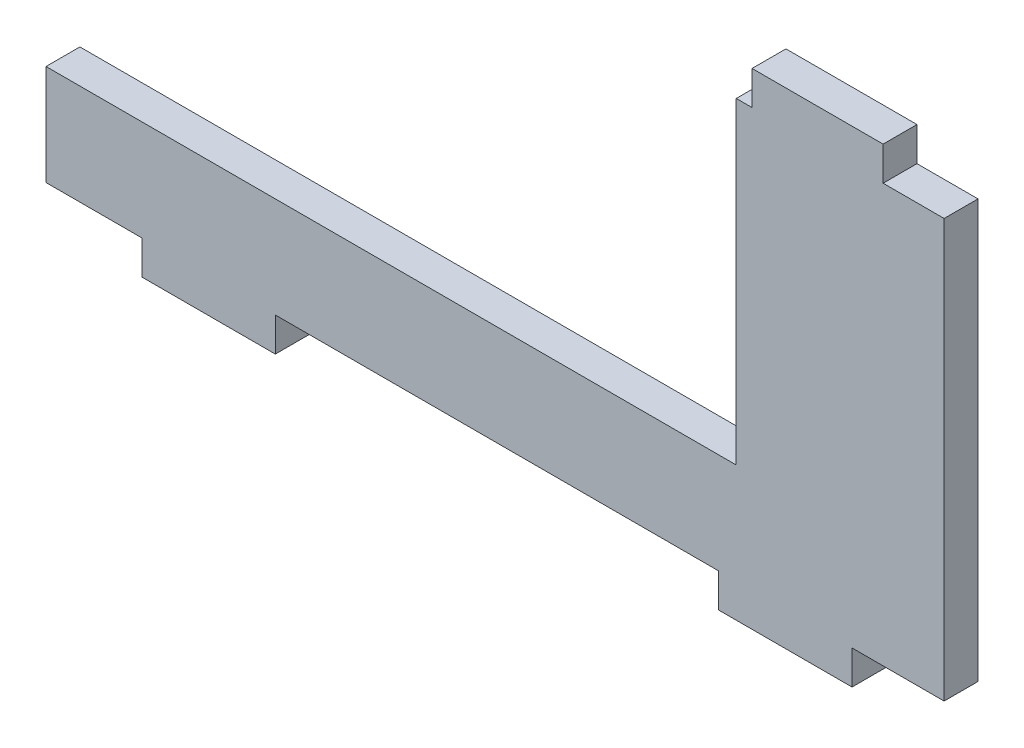
ISO-10303-21;
HEADER;
FILE_DESCRIPTION(('STEP AP214'),'2;1');
FILE_NAME('part.step','',(''),(''),'','','');
FILE_SCHEMA(('AUTOMOTIVE_DESIGN { 1 0 10303 214 1 1 1 1 }'));
ENDSEC;
DATA;
#1=APPLICATION_CONTEXT('core data for automotive mechanical design processes');
#2=APPLICATION_PROTOCOL_DEFINITION('international standard','automotive_design',2000,#1);
#3=PRODUCT_CONTEXT('',#1,'mechanical');
#4=PRODUCT('Part','Part','',(#3));
#5=PRODUCT_RELATED_PRODUCT_CATEGORY('part','',(#4));
#6=PRODUCT_DEFINITION_FORMATION('','',#4);
#7=PRODUCT_DEFINITION_CONTEXT('part definition',#1,'design');
#8=PRODUCT_DEFINITION('design','',#6,#7);
#9=PRODUCT_DEFINITION_SHAPE('','',#8);
#10=(LENGTH_UNIT() NAMED_UNIT(*) SI_UNIT(.MILLI.,.METRE.));
#11=(NAMED_UNIT(*) PLANE_ANGLE_UNIT() SI_UNIT($,.RADIAN.));
#12=(NAMED_UNIT(*) SI_UNIT($,.STERADIAN.) SOLID_ANGLE_UNIT());
#13=UNCERTAINTY_MEASURE_WITH_UNIT(LENGTH_MEASURE(1.E-05),#10,'distance_accuracy_value','');
#14=(GEOMETRIC_REPRESENTATION_CONTEXT(3) GLOBAL_UNCERTAINTY_ASSIGNED_CONTEXT((#13)) GLOBAL_UNIT_ASSIGNED_CONTEXT((#10,
#11,#12)) REPRESENTATION_CONTEXT('',''));
#15=CARTESIAN_POINT('',(0.,0.,0.));
#16=DIRECTION('',(0.,0.,1.));
#17=DIRECTION('',(1.,0.,0.));
#18=AXIS2_PLACEMENT_3D('',#15,#16,#17);
#19=CARTESIAN_POINT('',(0.,21.5,3.));
#20=DIRECTION('',(0.,1.,0.));
#21=DIRECTION('',(0.,0.,1.));
#22=AXIS2_PLACEMENT_3D('',#19,#20,#21);
#23=PLANE('',#22);
#24=DIRECTION('',(1.,0.,0.));
#25=VECTOR('',#24,1.);
#26=CARTESIAN_POINT('',(0.,21.5,0.));
#27=LINE('',#26,#25);
#28=CARTESIAN_POINT('',(22.75,21.5,0.));
#29=VERTEX_POINT('',#28);
#30=CARTESIAN_POINT('',(34.35,21.5,0.));
#31=VERTEX_POINT('',#30);
#32=EDGE_CURVE('E202',#29,#31,#27,.T.);
#33=ORIENTED_EDGE('',*,*,#32,.F.);
#34=DIRECTION('',(0.,0.,-1.));
#35=VECTOR('',#34,1.);
#36=CARTESIAN_POINT('',(22.75,21.5,3.));
#37=LINE('',#36,#35);
#38=CARTESIAN_POINT('',(22.75,21.5,3.));
#39=VERTEX_POINT('',#38);
#40=EDGE_CURVE('E11',#39,#29,#37,.T.);
#41=ORIENTED_EDGE('',*,*,#40,.F.);
#42=DIRECTION('',(1.,0.,0.));
#43=VECTOR('',#42,1.);
#44=CARTESIAN_POINT('',(0.,21.5,3.));
#45=LINE('',#44,#43);
#46=CARTESIAN_POINT('',(34.35,21.5,3.));
#47=VERTEX_POINT('',#46);
#48=EDGE_CURVE('E263',#39,#47,#45,.T.);
#49=ORIENTED_EDGE('',*,*,#48,.T.);
#50=DIRECTION('',(0.,0.,-1.));
#51=VECTOR('',#50,1.);
#52=CARTESIAN_POINT('',(34.35,21.5,3.));
#53=LINE('',#52,#51);
#54=EDGE_CURVE('E58',#47,#31,#53,.T.);
#55=ORIENTED_EDGE('',*,*,#54,.T.);
#56=EDGE_LOOP('',(#33,#41,#49,#55));
#57=FACE_BOUND('',#56,.T.);
#58=ADVANCED_FACE('F41',(#57),#23,.T.);
#59=CARTESIAN_POINT('',(22.75,0.,3.));
#60=DIRECTION('',(1.,0.,0.));
#61=DIRECTION('',(0.,0.,-1.));
#62=AXIS2_PLACEMENT_3D('',#59,#60,#61);
#63=PLANE('',#62);
#64=DIRECTION('',(0.,-1.,0.));
#65=VECTOR('',#64,1.);
#66=CARTESIAN_POINT('',(22.75,0.,0.));
#67=LINE('',#66,#65);
#68=CARTESIAN_POINT('',(22.75,18.5,0.));
#69=VERTEX_POINT('',#68);
#70=EDGE_CURVE('E205',#29,#69,#67,.T.);
#71=ORIENTED_EDGE('',*,*,#70,.T.);
#72=DIRECTION('',(0.,0.,-1.));
#73=VECTOR('',#72,1.);
#74=CARTESIAN_POINT('',(22.75,18.5,3.));
#75=LINE('',#74,#73);
#76=CARTESIAN_POINT('',(22.75,18.5,3.));
#77=VERTEX_POINT('',#76);
#78=EDGE_CURVE('E50',#77,#69,#75,.T.);
#79=ORIENTED_EDGE('',*,*,#78,.F.);
#80=DIRECTION('',(0.,-1.,0.));
#81=VECTOR('',#80,1.);
#82=CARTESIAN_POINT('',(22.75,0.,3.));
#83=LINE('',#82,#81);
#84=EDGE_CURVE('E336',#39,#77,#83,.T.);
#85=ORIENTED_EDGE('',*,*,#84,.F.);
#86=ORIENTED_EDGE('',*,*,#40,.T.);
#87=EDGE_LOOP('',(#71,#79,#85,#86));
#88=FACE_BOUND('',#87,.T.);
#89=ADVANCED_FACE('F320',(#88),#63,.F.);
#90=CARTESIAN_POINT('',(0.,18.5,3.));
#91=DIRECTION('',(0.,1.,0.));
#92=DIRECTION('',(0.,0.,1.));
#93=AXIS2_PLACEMENT_3D('',#90,#91,#92);
#94=PLANE('',#93);
#95=DIRECTION('',(1.,0.,0.));
#96=VECTOR('',#95,1.);
#97=CARTESIAN_POINT('',(0.,18.5,0.));
#98=LINE('',#97,#96);
#99=CARTESIAN_POINT('',(21.35,18.5,0.));
#100=VERTEX_POINT('',#99);
#101=EDGE_CURVE('E209',#100,#69,#98,.T.);
#102=ORIENTED_EDGE('',*,*,#101,.F.);
#103=DIRECTION('',(0.,0.,-1.));
#104=VECTOR('',#103,1.);
#105=CARTESIAN_POINT('',(21.35,18.5,3.));
#106=LINE('',#105,#104);
#107=CARTESIAN_POINT('',(21.35,18.5,3.));
#108=VERTEX_POINT('',#107);
#109=EDGE_CURVE('E308',#108,#100,#106,.T.);
#110=ORIENTED_EDGE('',*,*,#109,.F.);
#111=DIRECTION('',(1.,0.,0.));
#112=VECTOR('',#111,1.);
#113=CARTESIAN_POINT('',(0.,18.5,3.));
#114=LINE('',#113,#112);
#115=EDGE_CURVE('E317',#108,#77,#114,.T.);
#116=ORIENTED_EDGE('',*,*,#115,.T.);
#117=ORIENTED_EDGE('',*,*,#78,.T.);
#118=EDGE_LOOP('',(#102,#110,#116,#117));
#119=FACE_BOUND('',#118,.T.);
#120=ADVANCED_FACE('F315',(#119),#94,.T.);
#121=CARTESIAN_POINT('',(21.35,0.,3.));
#122=DIRECTION('',(1.,0.,0.));
#123=DIRECTION('',(0.,1.,0.));
#124=AXIS2_PLACEMENT_3D('',#121,#122,#123);
#125=PLANE('',#124);
#126=DIRECTION('',(0.,-1.,0.));
#127=VECTOR('',#126,1.);
#128=CARTESIAN_POINT('',(21.35,0.,0.));
#129=LINE('',#128,#127);
#130=CARTESIAN_POINT('',(21.35,-9.6,0.));
#131=VERTEX_POINT('',#130);
#132=EDGE_CURVE('E213',#100,#131,#129,.T.);
#133=ORIENTED_EDGE('',*,*,#132,.T.);
#134=DIRECTION('',(0.,0.,-1.));
#135=VECTOR('',#134,1.);
#136=CARTESIAN_POINT('',(21.35,-9.6,3.));
#137=LINE('',#136,#135);
#138=CARTESIAN_POINT('',(21.35,-9.6,3.));
#139=VERTEX_POINT('',#138);
#140=EDGE_CURVE('E305',#139,#131,#137,.T.);
#141=ORIENTED_EDGE('',*,*,#140,.F.);
#142=DIRECTION('',(0.,-1.,0.));
#143=VECTOR('',#142,1.);
#144=CARTESIAN_POINT('',(21.35,0.,3.));
#145=LINE('',#144,#143);
#146=EDGE_CURVE('E331',#108,#139,#145,.T.);
#147=ORIENTED_EDGE('',*,*,#146,.F.);
#148=ORIENTED_EDGE('',*,*,#109,.T.);
#149=EDGE_LOOP('',(#133,#141,#147,#148));
#150=FACE_BOUND('',#149,.T.);
#151=ADVANCED_FACE('F328',(#150),#125,.F.);
#152=CARTESIAN_POINT('',(0.,-9.6,3.));
#153=DIRECTION('',(0.,1.,0.));
#154=DIRECTION('',(0.,0.,1.));
#155=AXIS2_PLACEMENT_3D('',#152,#153,#154);
#156=PLANE('',#155);
#157=DIRECTION('',(1.,0.,0.));
#158=VECTOR('',#157,1.);
#159=CARTESIAN_POINT('',(0.,-9.6,0.));
#160=LINE('',#159,#158);
#161=CARTESIAN_POINT('',(-39.75,-9.6,0.));
#162=VERTEX_POINT('',#161);
#163=EDGE_CURVE('E217',#162,#131,#160,.T.);
#164=ORIENTED_EDGE('',*,*,#163,.F.);
#165=DIRECTION('',(0.,0.,-1.));
#166=VECTOR('',#165,1.);
#167=CARTESIAN_POINT('',(-39.75,-9.6,3.));
#168=LINE('',#167,#166);
#169=CARTESIAN_POINT('',(-39.75,-9.6,3.));
#170=VERTEX_POINT('',#169);
#171=EDGE_CURVE('E302',#170,#162,#168,.T.);
#172=ORIENTED_EDGE('',*,*,#171,.F.);
#173=DIRECTION('',(1.,0.,0.));
#174=VECTOR('',#173,1.);
#175=CARTESIAN_POINT('',(0.,-9.6,3.));
#176=LINE('',#175,#174);
#177=EDGE_CURVE('E334',#170,#139,#176,.T.);
#178=ORIENTED_EDGE('',*,*,#177,.T.);
#179=ORIENTED_EDGE('',*,*,#140,.T.);
#180=EDGE_LOOP('',(#164,#172,#178,#179));
#181=FACE_BOUND('',#180,.T.);
#182=ADVANCED_FACE('F405',(#181),#156,.T.);
#183=CARTESIAN_POINT('',(-39.75,0.,3.));
#184=DIRECTION('',(1.,0.,0.));
#185=DIRECTION('',(0.,1.,0.));
#186=AXIS2_PLACEMENT_3D('',#183,#184,#185);
#187=PLANE('',#186);
#188=DIRECTION('',(0.,-1.,0.));
#189=VECTOR('',#188,1.);
#190=CARTESIAN_POINT('',(-39.75,0.,0.));
#191=LINE('',#190,#189);
#192=CARTESIAN_POINT('',(-39.75,-18.5,0.));
#193=VERTEX_POINT('',#192);
#194=EDGE_CURVE('E221',#162,#193,#191,.T.);
#195=ORIENTED_EDGE('',*,*,#194,.T.);
#196=DIRECTION('',(0.,0.,-1.));
#197=VECTOR('',#196,1.);
#198=CARTESIAN_POINT('',(-39.75,-18.5,3.));
#199=LINE('',#198,#197);
#200=CARTESIAN_POINT('',(-39.75,-18.5,3.));
#201=VERTEX_POINT('',#200);
#202=EDGE_CURVE('E298',#201,#193,#199,.T.);
#203=ORIENTED_EDGE('',*,*,#202,.F.);
#204=DIRECTION('',(0.,-1.,0.));
#205=VECTOR('',#204,1.);
#206=CARTESIAN_POINT('',(-39.75,0.,3.));
#207=LINE('',#206,#205);
#208=EDGE_CURVE('E345',#170,#201,#207,.T.);
#209=ORIENTED_EDGE('',*,*,#208,.F.);
#210=ORIENTED_EDGE('',*,*,#171,.T.);
#211=EDGE_LOOP('',(#195,#203,#209,#210));
#212=FACE_BOUND('',#211,.T.);
#213=ADVANCED_FACE('F408',(#212),#187,.F.);
#214=CARTESIAN_POINT('',(0.,-18.5,3.));
#215=DIRECTION('',(0.,1.,0.));
#216=DIRECTION('',(0.,0.,1.));
#217=AXIS2_PLACEMENT_3D('',#214,#215,#216);
#218=PLANE('',#217);
#219=DIRECTION('',(1.,0.,0.));
#220=VECTOR('',#219,1.);
#221=CARTESIAN_POINT('',(0.,-18.5,0.));
#222=LINE('',#221,#220);
#223=CARTESIAN_POINT('',(-31.25,-18.5,0.));
#224=VERTEX_POINT('',#223);
#225=EDGE_CURVE('E224',#193,#224,#222,.T.);
#226=ORIENTED_EDGE('',*,*,#225,.T.);
#227=DIRECTION('',(0.,0.,-1.));
#228=VECTOR('',#227,1.);
#229=CARTESIAN_POINT('',(-31.25,-18.5,3.));
#230=LINE('',#229,#228);
#231=CARTESIAN_POINT('',(-31.25,-18.5,3.));
#232=VERTEX_POINT('',#231);
#233=EDGE_CURVE('E295',#232,#224,#230,.T.);
#234=ORIENTED_EDGE('',*,*,#233,.F.);
#235=DIRECTION('',(1.,0.,0.));
#236=VECTOR('',#235,1.);
#237=CARTESIAN_POINT('',(0.,-18.5,3.));
#238=LINE('',#237,#236);
#239=EDGE_CURVE('E348',#201,#232,#238,.T.);
#240=ORIENTED_EDGE('',*,*,#239,.F.);
#241=ORIENTED_EDGE('',*,*,#202,.T.);
#242=EDGE_LOOP('',(#226,#234,#240,#241));
#243=FACE_BOUND('',#242,.T.);
#244=ADVANCED_FACE('F412',(#243),#218,.F.);
#245=CARTESIAN_POINT('',(-31.25,0.,3.));
#246=DIRECTION('',(-1.,0.,0.));
#247=DIRECTION('',(0.,0.,1.));
#248=AXIS2_PLACEMENT_3D('',#245,#246,#247);
#249=PLANE('',#248);
#250=DIRECTION('',(0.,1.,0.));
#251=VECTOR('',#250,1.);
#252=CARTESIAN_POINT('',(-31.25,0.,0.));
#253=LINE('',#252,#251);
#254=CARTESIAN_POINT('',(-31.25,-21.5,0.));
#255=VERTEX_POINT('',#254);
#256=EDGE_CURVE('E228',#255,#224,#253,.T.);
#257=ORIENTED_EDGE('',*,*,#256,.F.);
#258=DIRECTION('',(0.,0.,-1.));
#259=VECTOR('',#258,1.);
#260=CARTESIAN_POINT('',(-31.25,-21.5,3.));
#261=LINE('',#260,#259);
#262=CARTESIAN_POINT('',(-31.25,-21.5,3.));
#263=VERTEX_POINT('',#262);
#264=EDGE_CURVE('E292',#263,#255,#261,.T.);
#265=ORIENTED_EDGE('',*,*,#264,.F.);
#266=DIRECTION('',(0.,1.,0.));
#267=VECTOR('',#266,1.);
#268=CARTESIAN_POINT('',(-31.25,0.,3.));
#269=LINE('',#268,#267);
#270=EDGE_CURVE('E351',#263,#232,#269,.T.);
#271=ORIENTED_EDGE('',*,*,#270,.T.);
#272=ORIENTED_EDGE('',*,*,#233,.T.);
#273=EDGE_LOOP('',(#257,#265,#271,#272));
#274=FACE_BOUND('',#273,.T.);
#275=ADVANCED_FACE('F416',(#274),#249,.T.);
#276=CARTESIAN_POINT('',(0.,-21.5,3.));
#277=DIRECTION('',(0.,1.,0.));
#278=DIRECTION('',(0.,0.,1.));
#279=AXIS2_PLACEMENT_3D('',#276,#277,#278);
#280=PLANE('',#279);
#281=DIRECTION('',(1.,0.,0.));
#282=VECTOR('',#281,1.);
#283=CARTESIAN_POINT('',(0.,-21.5,0.));
#284=LINE('',#283,#282);
#285=CARTESIAN_POINT('',(-19.45,-21.5,0.));
#286=VERTEX_POINT('',#285);
#287=EDGE_CURVE('E232',#255,#286,#284,.T.);
#288=ORIENTED_EDGE('',*,*,#287,.T.);
#289=DIRECTION('',(0.,0.,-1.));
#290=VECTOR('',#289,1.);
#291=CARTESIAN_POINT('',(-19.45,-21.5,3.));
#292=LINE('',#291,#290);
#293=CARTESIAN_POINT('',(-19.45,-21.5,3.));
#294=VERTEX_POINT('',#293);
#295=EDGE_CURVE('E288',#294,#286,#292,.T.);
#296=ORIENTED_EDGE('',*,*,#295,.F.);
#297=DIRECTION('',(1.,0.,0.));
#298=VECTOR('',#297,1.);
#299=CARTESIAN_POINT('',(0.,-21.5,3.));
#300=LINE('',#299,#298);
#301=EDGE_CURVE('E355',#263,#294,#300,.T.);
#302=ORIENTED_EDGE('',*,*,#301,.F.);
#303=ORIENTED_EDGE('',*,*,#264,.T.);
#304=EDGE_LOOP('',(#288,#296,#302,#303));
#305=FACE_BOUND('',#304,.T.);
#306=ADVANCED_FACE('F420',(#305),#280,.F.);
#307=CARTESIAN_POINT('',(-19.45,0.,3.));
#308=DIRECTION('',(-1.,0.,0.));
#309=DIRECTION('',(0.,0.,1.));
#310=AXIS2_PLACEMENT_3D('',#307,#308,#309);
#311=PLANE('',#310);
#312=DIRECTION('',(0.,1.,0.));
#313=VECTOR('',#312,1.);
#314=CARTESIAN_POINT('',(-19.45,0.,0.));
#315=LINE('',#314,#313);
#316=CARTESIAN_POINT('',(-19.45,-18.5,0.));
#317=VERTEX_POINT('',#316);
#318=EDGE_CURVE('E235',#286,#317,#315,.T.);
#319=ORIENTED_EDGE('',*,*,#318,.T.);
#320=DIRECTION('',(0.,0.,-1.));
#321=VECTOR('',#320,1.);
#322=CARTESIAN_POINT('',(-19.45,-18.5,3.));
#323=LINE('',#322,#321);
#324=CARTESIAN_POINT('',(-19.45,-18.5,3.));
#325=VERTEX_POINT('',#324);
#326=EDGE_CURVE('E284',#325,#317,#323,.T.);
#327=ORIENTED_EDGE('',*,*,#326,.F.);
#328=DIRECTION('',(0.,1.,0.));
#329=VECTOR('',#328,1.);
#330=CARTESIAN_POINT('',(-19.45,0.,3.));
#331=LINE('',#330,#329);
#332=EDGE_CURVE('E358',#294,#325,#331,.T.);
#333=ORIENTED_EDGE('',*,*,#332,.F.);
#334=ORIENTED_EDGE('',*,*,#295,.T.);
#335=EDGE_LOOP('',(#319,#327,#333,#334));
#336=FACE_BOUND('',#335,.T.);
#337=ADVANCED_FACE('F422',(#336),#311,.F.);
#338=CARTESIAN_POINT('',(0.,-18.5,3.));
#339=DIRECTION('',(0.,1.,0.));
#340=DIRECTION('',(0.,0.,1.));
#341=AXIS2_PLACEMENT_3D('',#338,#339,#340);
#342=PLANE('',#341);
#343=DIRECTION('',(1.,0.,0.));
#344=VECTOR('',#343,1.);
#345=CARTESIAN_POINT('',(0.,-18.5,0.));
#346=LINE('',#345,#344);
#347=CARTESIAN_POINT('',(19.8,-18.5,0.));
#348=VERTEX_POINT('',#347);
#349=EDGE_CURVE('E239',#317,#348,#346,.T.);
#350=ORIENTED_EDGE('',*,*,#349,.T.);
#351=DIRECTION('',(0.,0.,-1.));
#352=VECTOR('',#351,1.);
#353=CARTESIAN_POINT('',(19.8,-18.5,3.));
#354=LINE('',#353,#352);
#355=CARTESIAN_POINT('',(19.8,-18.5,3.));
#356=VERTEX_POINT('',#355);
#357=EDGE_CURVE('E281',#356,#348,#354,.T.);
#358=ORIENTED_EDGE('',*,*,#357,.F.);
#359=DIRECTION('',(1.,0.,0.));
#360=VECTOR('',#359,1.);
#361=CARTESIAN_POINT('',(0.,-18.5,3.));
#362=LINE('',#361,#360);
#363=EDGE_CURVE('E362',#325,#356,#362,.T.);
#364=ORIENTED_EDGE('',*,*,#363,.F.);
#365=ORIENTED_EDGE('',*,*,#326,.T.);
#366=EDGE_LOOP('',(#350,#358,#364,#365));
#367=FACE_BOUND('',#366,.T.);
#368=ADVANCED_FACE('F425',(#367),#342,.F.);
#369=CARTESIAN_POINT('',(19.8,0.,3.));
#370=DIRECTION('',(-1.,0.,0.));
#371=DIRECTION('',(0.,0.,1.));
#372=AXIS2_PLACEMENT_3D('',#369,#370,#371);
#373=PLANE('',#372);
#374=DIRECTION('',(0.,1.,0.));
#375=VECTOR('',#374,1.);
#376=CARTESIAN_POINT('',(19.8,0.,0.));
#377=LINE('',#376,#375);
#378=CARTESIAN_POINT('',(19.8,-21.5,0.));
#379=VERTEX_POINT('',#378);
#380=EDGE_CURVE('E243',#379,#348,#377,.T.);
#381=ORIENTED_EDGE('',*,*,#380,.F.);
#382=DIRECTION('',(0.,0.,-1.));
#383=VECTOR('',#382,1.);
#384=CARTESIAN_POINT('',(19.8,-21.5,3.));
#385=LINE('',#384,#383);
#386=CARTESIAN_POINT('',(19.8,-21.5,3.));
#387=VERTEX_POINT('',#386);
#388=EDGE_CURVE('E278',#387,#379,#385,.T.);
#389=ORIENTED_EDGE('',*,*,#388,.F.);
#390=DIRECTION('',(0.,1.,0.));
#391=VECTOR('',#390,1.);
#392=CARTESIAN_POINT('',(19.8,0.,3.));
#393=LINE('',#392,#391);
#394=EDGE_CURVE('E365',#387,#356,#393,.T.);
#395=ORIENTED_EDGE('',*,*,#394,.T.);
#396=ORIENTED_EDGE('',*,*,#357,.T.);
#397=EDGE_LOOP('',(#381,#389,#395,#396));
#398=FACE_BOUND('',#397,.T.);
#399=ADVANCED_FACE('F429',(#398),#373,.T.);
#400=CARTESIAN_POINT('',(31.6,-21.5,0.));
#401=VERTEX_POINT('',#400);
#402=EDGE_CURVE('E236',#379,#401,#284,.T.);
#403=ORIENTED_EDGE('',*,*,#402,.T.);
#404=DIRECTION('',(0.,0.,-1.));
#405=VECTOR('',#404,1.);
#406=CARTESIAN_POINT('',(31.6,-21.5,3.));
#407=LINE('',#406,#405);
#408=CARTESIAN_POINT('',(31.6,-21.5,3.));
#409=VERTEX_POINT('',#408);
#410=EDGE_CURVE('E274',#409,#401,#407,.T.);
#411=ORIENTED_EDGE('',*,*,#410,.F.);
#412=EDGE_CURVE('E359',#387,#409,#300,.T.);
#413=ORIENTED_EDGE('',*,*,#412,.F.);
#414=ORIENTED_EDGE('',*,*,#388,.T.);
#415=EDGE_LOOP('',(#403,#411,#413,#414));
#416=FACE_BOUND('',#415,.T.);
#417=ADVANCED_FACE('F376',(#416),#280,.F.);
#418=CARTESIAN_POINT('',(31.6,0.,3.));
#419=DIRECTION('',(-1.,0.,0.));
#420=DIRECTION('',(0.,0.,1.));
#421=AXIS2_PLACEMENT_3D('',#418,#419,#420);
#422=PLANE('',#421);
#423=DIRECTION('',(0.,1.,0.));
#424=VECTOR('',#423,1.);
#425=CARTESIAN_POINT('',(31.6,0.,0.));
#426=LINE('',#425,#424);
#427=CARTESIAN_POINT('',(31.6,-18.5,0.));
#428=VERTEX_POINT('',#427);
#429=EDGE_CURVE('E247',#401,#428,#426,.T.);
#430=ORIENTED_EDGE('',*,*,#429,.T.);
#431=DIRECTION('',(0.,0.,-1.));
#432=VECTOR('',#431,1.);
#433=CARTESIAN_POINT('',(31.6,-18.5,3.));
#434=LINE('',#433,#432);
#435=CARTESIAN_POINT('',(31.6,-18.5,3.));
#436=VERTEX_POINT('',#435);
#437=EDGE_CURVE('E270',#436,#428,#434,.T.);
#438=ORIENTED_EDGE('',*,*,#437,.F.);
#439=DIRECTION('',(0.,1.,0.));
#440=VECTOR('',#439,1.);
#441=CARTESIAN_POINT('',(31.6,0.,3.));
#442=LINE('',#441,#440);
#443=EDGE_CURVE('E196',#409,#436,#442,.T.);
#444=ORIENTED_EDGE('',*,*,#443,.F.);
#445=ORIENTED_EDGE('',*,*,#410,.T.);
#446=EDGE_LOOP('',(#430,#438,#444,#445));
#447=FACE_BOUND('',#446,.T.);
#448=ADVANCED_FACE('F380',(#447),#422,.F.);
#449=CARTESIAN_POINT('',(0.,-18.5,3.));
#450=DIRECTION('',(0.,1.,0.));
#451=DIRECTION('',(0.,0.,1.));
#452=AXIS2_PLACEMENT_3D('',#449,#450,#451);
#453=PLANE('',#452);
#454=DIRECTION('',(1.,0.,0.));
#455=VECTOR('',#454,1.);
#456=CARTESIAN_POINT('',(0.,-18.5,0.));
#457=LINE('',#456,#455);
#458=CARTESIAN_POINT('',(39.75,-18.5,0.));
#459=VERTEX_POINT('',#458);
#460=EDGE_CURVE('E250',#428,#459,#457,.T.);
#461=ORIENTED_EDGE('',*,*,#460,.T.);
#462=DIRECTION('',(0.,0.,-1.));
#463=VECTOR('',#462,1.);
#464=CARTESIAN_POINT('',(39.75,-18.5,3.));
#465=LINE('',#464,#463);
#466=CARTESIAN_POINT('',(39.75,-18.5,3.));
#467=VERTEX_POINT('',#466);
#468=EDGE_CURVE('E179',#467,#459,#465,.T.);
#469=ORIENTED_EDGE('',*,*,#468,.F.);
#470=DIRECTION('',(1.,0.,0.));
#471=VECTOR('',#470,1.);
#472=CARTESIAN_POINT('',(0.,-18.5,3.));
#473=LINE('',#472,#471);
#474=EDGE_CURVE('E191',#436,#467,#473,.T.);
#475=ORIENTED_EDGE('',*,*,#474,.F.);
#476=ORIENTED_EDGE('',*,*,#437,.T.);
#477=EDGE_LOOP('',(#461,#469,#475,#476));
#478=FACE_BOUND('',#477,.T.);
#479=ADVANCED_FACE('F383',(#478),#453,.F.);
#480=CARTESIAN_POINT('',(39.75,0.,3.));
#481=DIRECTION('',(1.,0.,0.));
#482=DIRECTION('',(0.,0.,-1.));
#483=AXIS2_PLACEMENT_3D('',#480,#481,#482);
#484=PLANE('',#483);
#485=DIRECTION('',(0.,-1.,0.));
#486=VECTOR('',#485,1.);
#487=CARTESIAN_POINT('',(39.75,0.,0.));
#488=LINE('',#487,#486);
#489=CARTESIAN_POINT('',(39.75,18.5,0.));
#490=VERTEX_POINT('',#489);
#491=EDGE_CURVE('E175',#490,#459,#488,.T.);
#492=ORIENTED_EDGE('',*,*,#491,.F.);
#493=DIRECTION('',(0.,0.,-1.));
#494=VECTOR('',#493,1.);
#495=CARTESIAN_POINT('',(39.75,18.5,3.));
#496=LINE('',#495,#494);
#497=CARTESIAN_POINT('',(39.75,18.5,3.));
#498=VERTEX_POINT('',#497);
#499=EDGE_CURVE('E169',#498,#490,#496,.T.);
#500=ORIENTED_EDGE('',*,*,#499,.F.);
#501=DIRECTION('',(0.,-1.,0.));
#502=VECTOR('',#501,1.);
#503=CARTESIAN_POINT('',(39.75,0.,3.));
#504=LINE('',#503,#502);
#505=EDGE_CURVE('E173',#498,#467,#504,.T.);
#506=ORIENTED_EDGE('',*,*,#505,.T.);
#507=ORIENTED_EDGE('',*,*,#468,.T.);
#508=EDGE_LOOP('',(#492,#500,#506,#507));
#509=FACE_BOUND('',#508,.T.);
#510=ADVANCED_FACE('F171',(#509),#484,.T.);
#511=CARTESIAN_POINT('',(0.,18.5,3.));
#512=DIRECTION('',(0.,-1.,0.));
#513=DIRECTION('',(0.,0.,-1.));
#514=AXIS2_PLACEMENT_3D('',#511,#512,#513);
#515=PLANE('',#514);
#516=DIRECTION('',(-1.,0.,0.));
#517=VECTOR('',#516,1.);
#518=CARTESIAN_POINT('',(0.,18.5,0.));
#519=LINE('',#518,#517);
#520=CARTESIAN_POINT('',(34.35,18.5,0.));
#521=VERTEX_POINT('',#520);
#522=EDGE_CURVE('E256',#490,#521,#519,.T.);
#523=ORIENTED_EDGE('',*,*,#522,.T.);
#524=DIRECTION('',(0.,0.,-1.));
#525=VECTOR('',#524,1.);
#526=CARTESIAN_POINT('',(34.35,18.5,3.));
#527=LINE('',#526,#525);
#528=CARTESIAN_POINT('',(34.35,18.5,3.));
#529=VERTEX_POINT('',#528);
#530=EDGE_CURVE('E114',#529,#521,#527,.T.);
#531=ORIENTED_EDGE('',*,*,#530,.F.);
#532=DIRECTION('',(-1.,0.,0.));
#533=VECTOR('',#532,1.);
#534=CARTESIAN_POINT('',(0.,18.5,3.));
#535=LINE('',#534,#533);
#536=EDGE_CURVE('E181',#498,#529,#535,.T.);
#537=ORIENTED_EDGE('',*,*,#536,.F.);
#538=ORIENTED_EDGE('',*,*,#499,.T.);
#539=EDGE_LOOP('',(#523,#531,#537,#538));
#540=FACE_BOUND('',#539,.T.);
#541=ADVANCED_FACE('F182',(#540),#515,.F.);
#542=CARTESIAN_POINT('',(34.35,0.,3.));
#543=DIRECTION('',(1.,0.,0.));
#544=DIRECTION('',(0.,0.,-1.));
#545=AXIS2_PLACEMENT_3D('',#542,#543,#544);
#546=PLANE('',#545);
#547=DIRECTION('',(0.,-1.,0.));
#548=VECTOR('',#547,1.);
#549=CARTESIAN_POINT('',(34.35,0.,0.));
#550=LINE('',#549,#548);
#551=EDGE_CURVE('E259',#31,#521,#550,.T.);
#552=ORIENTED_EDGE('',*,*,#551,.F.);
#553=ORIENTED_EDGE('',*,*,#54,.F.);
#554=DIRECTION('',(0.,-1.,0.));
#555=VECTOR('',#554,1.);
#556=CARTESIAN_POINT('',(34.35,0.,3.));
#557=LINE('',#556,#555);
#558=EDGE_CURVE('E186',#47,#529,#557,.T.);
#559=ORIENTED_EDGE('',*,*,#558,.T.);
#560=ORIENTED_EDGE('',*,*,#530,.T.);
#561=EDGE_LOOP('',(#552,#553,#559,#560));
#562=FACE_BOUND('',#561,.T.);
#563=ADVANCED_FACE('F384',(#562),#546,.T.);
#564=CARTESIAN_POINT('',(0.,0.,3.));
#565=DIRECTION('',(0.,0.,1.));
#566=DIRECTION('',(1.,0.,0.));
#567=AXIS2_PLACEMENT_3D('',#564,#565,#566);
#568=PLANE('',#567);
#569=ORIENTED_EDGE('',*,*,#48,.F.);
#570=ORIENTED_EDGE('',*,*,#84,.T.);
#571=ORIENTED_EDGE('',*,*,#115,.F.);
#572=ORIENTED_EDGE('',*,*,#146,.T.);
#573=ORIENTED_EDGE('',*,*,#177,.F.);
#574=ORIENTED_EDGE('',*,*,#208,.T.);
#575=ORIENTED_EDGE('',*,*,#239,.T.);
#576=ORIENTED_EDGE('',*,*,#270,.F.);
#577=ORIENTED_EDGE('',*,*,#301,.T.);
#578=ORIENTED_EDGE('',*,*,#332,.T.);
#579=ORIENTED_EDGE('',*,*,#363,.T.);
#580=ORIENTED_EDGE('',*,*,#394,.F.);
#581=ORIENTED_EDGE('',*,*,#412,.T.);
#582=ORIENTED_EDGE('',*,*,#443,.T.);
#583=ORIENTED_EDGE('',*,*,#474,.T.);
#584=ORIENTED_EDGE('',*,*,#505,.F.);
#585=ORIENTED_EDGE('',*,*,#536,.T.);
#586=ORIENTED_EDGE('',*,*,#558,.F.);
#587=EDGE_LOOP('',(#569,#570,#571,#572,#573,#574,#575,#576,#577,#578,#579,#580,#581,#582,#583,
#584,#585,#586));
#588=FACE_BOUND('',#587,.T.);
#589=ADVANCED_FACE('F189',(#588),#568,.T.);
#590=CARTESIAN_POINT('',(0.,0.,0.));
#591=DIRECTION('',(0.,0.,1.));
#592=DIRECTION('',(1.,0.,0.));
#593=AXIS2_PLACEMENT_3D('',#590,#591,#592);
#594=PLANE('',#593);
#595=ORIENTED_EDGE('',*,*,#32,.T.);
#596=ORIENTED_EDGE('',*,*,#551,.T.);
#597=ORIENTED_EDGE('',*,*,#522,.F.);
#598=ORIENTED_EDGE('',*,*,#491,.T.);
#599=ORIENTED_EDGE('',*,*,#460,.F.);
#600=ORIENTED_EDGE('',*,*,#429,.F.);
#601=ORIENTED_EDGE('',*,*,#402,.F.);
#602=ORIENTED_EDGE('',*,*,#380,.T.);
#603=ORIENTED_EDGE('',*,*,#349,.F.);
#604=ORIENTED_EDGE('',*,*,#318,.F.);
#605=ORIENTED_EDGE('',*,*,#287,.F.);
#606=ORIENTED_EDGE('',*,*,#256,.T.);
#607=ORIENTED_EDGE('',*,*,#225,.F.);
#608=ORIENTED_EDGE('',*,*,#194,.F.);
#609=ORIENTED_EDGE('',*,*,#163,.T.);
#610=ORIENTED_EDGE('',*,*,#132,.F.);
#611=ORIENTED_EDGE('',*,*,#101,.T.);
#612=ORIENTED_EDGE('',*,*,#70,.F.);
#613=EDGE_LOOP('',(#595,#596,#597,#598,#599,#600,#601,#602,#603,#604,#605,#606,#607,#608,#609,
#610,#611,#612));
#614=FACE_BOUND('',#613,.T.);
#615=ADVANCED_FACE('F323',(#614),#594,.F.);
#616=CLOSED_SHELL('',(#58,#89,#120,#151,#182,#213,#244,#275,#306,#337,#368,#399,#417,#448,#479,
#510,#541,#563,#589,#615));
#617=MANIFOLD_SOLID_BREP('B2',#616);
#618=ADVANCED_BREP_SHAPE_REPRESENTATION('',(#18,#617),#14);
#619=SHAPE_DEFINITION_REPRESENTATION(#9,#618);
ENDSEC;
END-ISO-10303-21;
